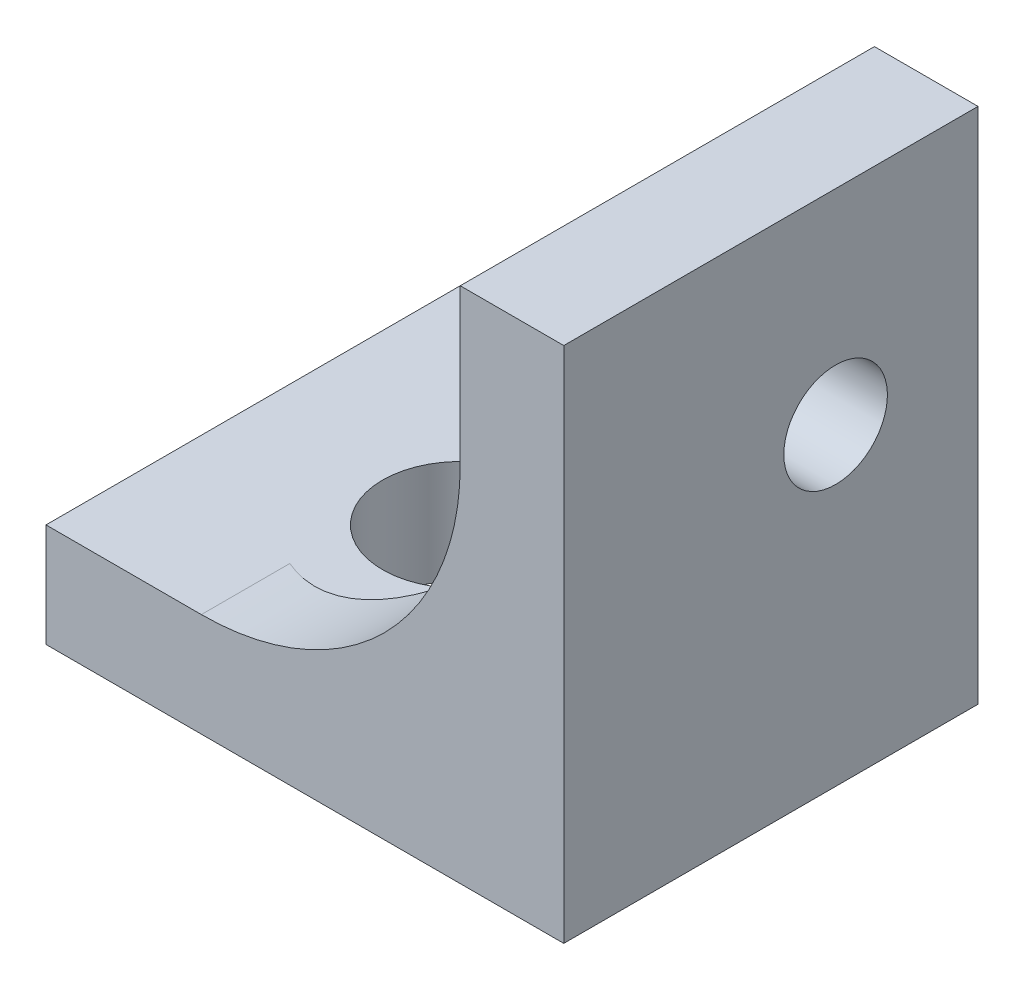
ISO-10303-21;
HEADER;
FILE_DESCRIPTION(('STEP AP214'),'2;1');
FILE_NAME('part.step','',(''),(''),'','','');
FILE_SCHEMA(('AUTOMOTIVE_DESIGN { 1 0 10303 214 1 1 1 1 }'));
ENDSEC;
DATA;
#1=APPLICATION_CONTEXT('core data for automotive mechanical design processes');
#2=APPLICATION_PROTOCOL_DEFINITION('international standard','automotive_design',2000,#1);
#3=PRODUCT_CONTEXT('',#1,'mechanical');
#4=PRODUCT('Part','Part','',(#3));
#5=PRODUCT_RELATED_PRODUCT_CATEGORY('part','',(#4));
#6=PRODUCT_DEFINITION_FORMATION('','',#4);
#7=PRODUCT_DEFINITION_CONTEXT('part definition',#1,'design');
#8=PRODUCT_DEFINITION('design','',#6,#7);
#9=PRODUCT_DEFINITION_SHAPE('','',#8);
#10=(LENGTH_UNIT() NAMED_UNIT(*) SI_UNIT(.MILLI.,.METRE.));
#11=(NAMED_UNIT(*) PLANE_ANGLE_UNIT() SI_UNIT($,.RADIAN.));
#12=(NAMED_UNIT(*) SI_UNIT($,.STERADIAN.) SOLID_ANGLE_UNIT());
#13=UNCERTAINTY_MEASURE_WITH_UNIT(LENGTH_MEASURE(1.E-05),#10,'distance_accuracy_value','');
#14=(GEOMETRIC_REPRESENTATION_CONTEXT(3) GLOBAL_UNCERTAINTY_ASSIGNED_CONTEXT((#13)) GLOBAL_UNIT_ASSIGNED_CONTEXT((#10,
#11,#12)) REPRESENTATION_CONTEXT('',''));
#15=CARTESIAN_POINT('',(0.,0.,0.));
#16=DIRECTION('',(0.,0.,1.));
#17=DIRECTION('',(1.,0.,0.));
#18=AXIS2_PLACEMENT_3D('',#15,#16,#17);
#19=CARTESIAN_POINT('',(-7.,7.,4.));
#20=DIRECTION('',(0.,0.,1.));
#21=DIRECTION('',(1.,0.,0.));
#22=AXIS2_PLACEMENT_3D('',#19,#20,#21);
#23=CYLINDRICAL_SURFACE('',#22,5.);
#24=CARTESIAN_POINT('',(-2.,7.,-2.71969384566991));
#25=CARTESIAN_POINT('',(-1.99999867804241,6.96038055154379,-2.74530406939443));
#26=CARTESIAN_POINT('',(-2.00047164656441,6.91974123514812,-2.76929938437319));
#27=CARTESIAN_POINT('',(-2.00249534014122,6.83667934654765,-2.81392471658101));
#28=CARTESIAN_POINT('',(-2.00404610643408,6.79425670616876,-2.83455460500687));
#29=CARTESIAN_POINT('',(-2.01049830280839,6.66491432502792,-2.89109784935793));
#30=CARTESIAN_POINT('',(-2.0171983755155,6.57572390611684,-2.92179126999705));
#31=CARTESIAN_POINT('',(-2.03600912614743,6.39407270780982,-2.96840841168465));
#32=CARTESIAN_POINT('',(-2.04812482898309,6.30160896478487,-2.98431837354393));
#33=CARTESIAN_POINT('',(-2.07783095478387,6.11622453922833,-3.0012205909028));
#34=CARTESIAN_POINT('',(-2.09542029643804,6.02330395051123,-3.00221579088895));
#35=CARTESIAN_POINT('',(-2.13570181172784,5.83916828172634,-2.98971501753192));
#36=CARTESIAN_POINT('',(-2.15841610957023,5.74796251109971,-2.97615522778554));
#37=CARTESIAN_POINT('',(-2.20800481489154,5.5698454363075,-2.93532181309561));
#38=CARTESIAN_POINT('',(-2.23488127053931,5.48293627440118,-2.90804142140318));
#39=CARTESIAN_POINT('',(-2.29344109394283,5.30967279042823,-2.83861293114494));
#40=CARTESIAN_POINT('',(-2.32532442055952,5.22373154021282,-2.79560439035784));
#41=CARTESIAN_POINT('',(-2.39068723878888,5.06041586547692,-2.69649844284674));
#42=CARTESIAN_POINT('',(-2.42416745957263,4.98304540916136,-2.64039501033892));
#43=CARTESIAN_POINT('',(-2.49334219048328,4.83264972669039,-2.51139812253799));
#44=CARTESIAN_POINT('',(-2.52900498162388,4.76043818085067,-2.43753441079985));
#45=CARTESIAN_POINT('',(-2.59703732742944,4.62947777373248,-2.27728938929331));
#46=CARTESIAN_POINT('',(-2.62940583636023,4.57073318002588,-2.19090412565943));
#47=CARTESIAN_POINT('',(-2.68713893649717,4.46966947272381,-2.00876264992836));
#48=CARTESIAN_POINT('',(-2.71260771209724,4.42710159546281,-1.91317931805099));
#49=CARTESIAN_POINT('',(-2.75395330028,4.35941406929208,-1.71412797213516));
#50=CARTESIAN_POINT('',(-2.76984773589638,4.33426235044072,-1.61067484159505));
#51=CARTESIAN_POINT('',(-2.78819399357045,4.30538792059023,-1.41487942753203));
#52=CARTESIAN_POINT('',(-2.7922409330295,4.29911863076448,-1.32305934670922));
#53=CARTESIAN_POINT('',(-2.79098143941577,4.3010800427812,-1.13964879767555));
#54=CARTESIAN_POINT('',(-2.78567802810436,4.3093060601616,-1.0480582648603));
#55=CARTESIAN_POINT('',(-2.76730450895817,4.3383204198497,-0.876456657996809));
#56=CARTESIAN_POINT('',(-2.75498734256853,4.35789384091786,-0.796151634503493));
#57=CARTESIAN_POINT('',(-2.72441071161088,4.40766803456794,-0.64011795055982));
#58=CARTESIAN_POINT('',(-2.70614968056924,4.43787160884045,-0.564390502749947));
#59=CARTESIAN_POINT('',(-2.66353215930569,4.51063182584533,-0.41307519215602));
#60=CARTESIAN_POINT('',(-2.63880770078916,4.55397679137175,-0.337972459829501));
#61=CARTESIAN_POINT('',(-2.58602526341888,4.65056249100747,-0.195734774209249));
#62=CARTESIAN_POINT('',(-2.55796558268198,4.70380828515845,-0.12860392400199));
#63=CARTESIAN_POINT('',(-2.49602740313364,4.82751806618557,0.00601206104081807));
#64=CARTESIAN_POINT('',(-2.46189736645987,4.89936084390679,0.0721188568921348));
#65=CARTESIAN_POINT('',(-2.39384354783236,5.05310586009823,0.191592551975834));
#66=CARTESIAN_POINT('',(-2.35991991834914,5.13501476496842,0.244950938833224));
#67=CARTESIAN_POINT('',(-2.2921284062949,5.31310745537378,0.340716237850486));
#68=CARTESIAN_POINT('',(-2.25841713255764,5.40988039054042,0.382147553342853));
#69=CARTESIAN_POINT('',(-2.19575791710927,5.61065219764031,0.447229285581904));
#70=CARTESIAN_POINT('',(-2.16680622358936,5.71464528530952,0.470893760300303));
#71=CARTESIAN_POINT('',(-2.11673890430772,5.92092254542664,0.498160391485404));
#72=CARTESIAN_POINT('',(-2.09528003841527,6.02298647350299,0.50279377222896));
#73=CARTESIAN_POINT('',(-2.05893090202978,6.22760282597387,0.493965136591627));
#74=CARTESIAN_POINT('',(-2.04404023107244,6.33015522020103,0.48050422362642));
#75=CARTESIAN_POINT('',(-2.02673648507832,6.48112402780369,0.446847346293491));
#76=CARTESIAN_POINT('',(-2.02181266094272,6.53086331494279,0.433428634479487));
#77=CARTESIAN_POINT('',(-2.01353272925488,6.62910186045213,0.402208310142303));
#78=CARTESIAN_POINT('',(-2.01017671748865,6.67760104288669,0.384406429929458));
#79=CARTESIAN_POINT('',(-2.00492538150202,6.77302301944444,0.344496582096798));
#80=CARTESIAN_POINT('',(-2.00303398677853,6.81994125199201,0.322377228364049));
#81=CARTESIAN_POINT('',(-2.00056856073206,6.91165983724819,0.274052632839682));
#82=CARTESIAN_POINT('',(-1.99999450738326,6.95646022535466,0.247847459370385));
#83=CARTESIAN_POINT('',(-2.,7.,0.219693845669907));
#84=B_SPLINE_CURVE_WITH_KNOTS('',3,(#24,#25,#26,#27,#28,#29,#30,#31,#32,#33,#34,#35,#36,#37,#38,
#39,#40,#41,#42,#43,#44,#45,#46,#47,#48,#49,#50,#51,#52,#53,#54,#55,#56,#57,#58,#59,#60,#61,#62,
#63,#64,#65,#66,#67,#68,#69,#70,#71,#72,#73,#74,#75,#76,#77,#78,#79,#80,#81,#82,#83),
.UNSPECIFIED.,.F.,.F.,(4,2,2,2,2,2,2,2,2,2,2,2,2,2,2,2,2,2,2,2,2,2,2,2,2,2,2,2,2,4),(0.,
0.141445774767373,0.282896961744636,0.565107887498639,0.847581208920995,1.12999876345519,
1.41365965589029,1.69746058204911,1.99994218724748,2.30256325864533,2.62886299270558,
2.95526598610493,3.2764242067249,3.59698946578993,3.87179136397493,4.14650447045827,
4.39614776660585,4.64585690824766,4.91532374998678,5.18492868924562,5.49388338806945,
5.80304380934016,6.13295762301685,6.46261011723661,6.77414339594943,7.08565767778311,
7.24072945131146,7.39581069776172,7.55130659182139,7.70679988598637),.UNSPECIFIED.);
#85=CARTESIAN_POINT('',(-2.,7.,-2.7196938456699));
#86=VERTEX_POINT('',#85);
#87=CARTESIAN_POINT('',(-2.,7.,0.219693845669906));
#88=VERTEX_POINT('',#87);
#89=EDGE_CURVE('E113',#86,#88,#84,.T.);
#90=ORIENTED_EDGE('',*,*,#89,.F.);
#91=DIRECTION('',(0.,0.,-1.));
#92=VECTOR('',#91,1.);
#93=CARTESIAN_POINT('',(-2.,7.,4.));
#94=LINE('',#93,#92);
#95=CARTESIAN_POINT('',(-2.,7.,-4.));
#96=VERTEX_POINT('',#95);
#97=EDGE_CURVE('E123',#96,#86,#94,.F.);
#98=ORIENTED_EDGE('',*,*,#97,.F.);
#99=CARTESIAN_POINT('',(-7.,7.,-4.));
#100=DIRECTION('',(0.,0.,1.));
#101=DIRECTION('',(1.,0.,0.));
#102=AXIS2_PLACEMENT_3D('',#99,#100,#101);
#103=CIRCLE('',#102,5.);
#104=CARTESIAN_POINT('',(-7.,2.,-4.));
#105=VERTEX_POINT('',#104);
#106=EDGE_CURVE('E129',#105,#96,#103,.T.);
#107=ORIENTED_EDGE('',*,*,#106,.F.);
#108=DIRECTION('',(0.,0.,-1.));
#109=VECTOR('',#108,1.);
#110=CARTESIAN_POINT('',(-7.,2.,-4.));
#111=LINE('',#110,#109);
#112=CARTESIAN_POINT('',(-7.,2.,-2.29128784747792));
#113=VERTEX_POINT('',#112);
#114=EDGE_CURVE('E131',#113,#105,#111,.T.);
#115=ORIENTED_EDGE('',*,*,#114,.F.);
#116=CARTESIAN_POINT('',(-7.,2.,2.29128784747792));
#117=CARTESIAN_POINT('',(-6.94096198477514,1.99999114721002,2.31706454380835));
#118=CARTESIAN_POINT('',(-6.88091838617668,2.00104545803731,2.3405427218191));
#119=CARTESIAN_POINT('',(-6.75927544306799,2.00542966220429,2.38277858873866));
#120=CARTESIAN_POINT('',(-6.69767611366641,2.00875953345281,2.40153632347119));
#121=CARTESIAN_POINT('',(-6.57356747684374,2.01783011104039,2.43415801837006));
#122=CARTESIAN_POINT('',(-6.51106155835243,2.0235633569466,2.4480368802426));
#123=CARTESIAN_POINT('',(-6.38545900662037,2.03750646241955,2.47093159657459));
#124=CARTESIAN_POINT('',(-6.32236240453439,2.04571619207281,2.47994770605927));
#125=CARTESIAN_POINT('',(-6.13281515424676,2.07412554880528,2.49969114729352));
#126=CARTESIAN_POINT('',(-6.0060769240425,2.0981074672309,2.50312142115184));
#127=CARTESIAN_POINT('',(-5.75577042764084,2.15557667739918,2.491203692425));
#128=CARTESIAN_POINT('',(-5.6322030589092,2.18906662858915,2.47585043200378));
#129=CARTESIAN_POINT('',(-5.38833747956002,2.2651055098891,2.427277861546));
#130=CARTESIAN_POINT('',(-5.26818012943385,2.30784533437773,2.39365517434472));
#131=CARTESIAN_POINT('',(-5.03642846732498,2.40000300927694,2.31013563825121));
#132=CARTESIAN_POINT('',(-4.92483766014765,2.4494235703686,2.26023217182328));
#133=CARTESIAN_POINT('',(-4.69802745958016,2.55941872378511,2.13857116038279));
#134=CARTESIAN_POINT('',(-4.58417149296455,2.6206113507234,2.06483406389245));
#135=CARTESIAN_POINT('',(-4.37046150514378,2.74548617539239,1.90073524019834));
#136=CARTESIAN_POINT('',(-4.27062935087434,2.80917206737534,1.81034804718773));
#137=CARTESIAN_POINT('',(-4.07378345831024,2.94373433611529,1.60095996517152));
#138=CARTESIAN_POINT('',(-3.97897933699119,3.01441749366705,1.47974217495322));
#139=CARTESIAN_POINT('',(-3.81161737336704,3.14700413471519,1.21857661319708));
#140=CARTESIAN_POINT('',(-3.73901440084266,3.20892528988467,1.07866768047825));
#141=CARTESIAN_POINT('',(-3.64015967736329,3.2967201200565,0.832066492851735));
#142=CARTESIAN_POINT('',(-3.60653671067226,3.32770151434879,0.730154003864886));
#143=CARTESIAN_POINT('',(-3.55235061862624,3.37852186457462,0.520297210142897));
#144=CARTESIAN_POINT('',(-3.53176510746992,3.39837991289705,0.412363592646484));
#145=CARTESIAN_POINT('',(-3.50492247996616,3.42441445787553,0.192227375625661));
#146=CARTESIAN_POINT('',(-3.49876925975788,3.43049173829739,0.079999697037371));
#147=CARTESIAN_POINT('',(-3.50164141651307,3.42767731307922,-0.144082408565495));
#148=CARTESIAN_POINT('',(-3.51066849878968,3.41878392567573,-0.255936792230759));
#149=CARTESIAN_POINT('',(-3.54157984844148,3.38894535960462,-0.465074324780901));
#150=CARTESIAN_POINT('',(-3.56216917304701,3.36921785858062,-0.562735872137342));
#151=CARTESIAN_POINT('',(-3.61401461105216,3.32082097472011,-0.752861763580056));
#152=CARTESIAN_POINT('',(-3.64527963207713,3.29214412642051,-0.845321692240169));
#153=CARTESIAN_POINT('',(-3.734330717145,3.21312876224577,-1.06624187044088));
#154=CARTESIAN_POINT('',(-3.79766914346787,3.15895508615215,-1.19109185052261));
#155=CARTESIAN_POINT('',(-3.94206443766487,3.04302821598333,-1.42618349262765));
#156=CARTESIAN_POINT('',(-4.02315211617814,2.98126192478186,-1.53639921002829));
#157=CARTESIAN_POINT('',(-4.20300415244097,2.85401309557393,-1.74355668045803));
#158=CARTESIAN_POINT('',(-4.30209186314221,2.78848074592646,-1.84018610079824));
#159=CARTESIAN_POINT('',(-4.51557381038937,2.65912713692152,-2.01633412232465));
#160=CARTESIAN_POINT('',(-4.62996896632202,2.59530598061733,-2.09585169500038));
#161=CARTESIAN_POINT('',(-4.81881139310086,2.50020292661337,-2.20474194179813));
#162=CARTESIAN_POINT('',(-4.88855481799534,2.46701176280033,-2.24073979802579));
#163=CARTESIAN_POINT('',(-5.03198326195212,2.40292851918174,-2.30632938204848));
#164=CARTESIAN_POINT('',(-5.10566635183662,2.37203533150633,-2.33592421009499));
#165=CARTESIAN_POINT('',(-5.25650339281285,2.31312752374316,-2.38821720007174));
#166=CARTESIAN_POINT('',(-5.33365544123344,2.28511135269217,-2.41091909095104));
#167=CARTESIAN_POINT('',(-5.4908766243784,2.23246261804924,-2.44894460438466));
#168=CARTESIAN_POINT('',(-5.5709450856177,2.20782927945193,-2.46426991893144));
#169=CARTESIAN_POINT('',(-5.72337486721809,2.16515665881619,-2.48569116847772));
#170=CARTESIAN_POINT('',(-5.79548843700092,2.14667973068413,-2.49268325546851));
#171=CARTESIAN_POINT('',(-5.9407849419537,2.11291258862531,-2.50035672736334));
#172=CARTESIAN_POINT('',(-6.01396768054886,2.09762179660108,-2.50103925805934));
#173=CARTESIAN_POINT('',(-6.16065954978825,2.07038886961839,-2.49591034519498));
#174=CARTESIAN_POINT('',(-6.23416830416922,2.05844356621296,-2.49010507229441));
#175=CARTESIAN_POINT('',(-6.38081478754785,2.03793446198803,-2.47193037653216));
#176=CARTESIAN_POINT('',(-6.45395265360361,2.02936930605651,-2.4595635888742));
#177=CARTESIAN_POINT('',(-6.60753526937869,2.01476500371238,-2.4264690019102));
#178=CARTESIAN_POINT('',(-6.6878471131274,2.00913242371626,-2.40493980885806));
#179=CARTESIAN_POINT('',(-6.84600202563025,2.00173832478192,-2.35397884251859));
#180=CARTESIAN_POINT('',(-6.92384791645423,1.99997221071715,-2.32455649665569));
#181=CARTESIAN_POINT('',(-7.,2.,-2.29128784747792));
#182=B_SPLINE_CURVE_WITH_KNOTS('',3,(#116,#117,#118,#119,#120,#121,#122,#123,#124,#125,#126,
#127,#128,#129,#130,#131,#132,#133,#134,#135,#136,#137,#138,#139,#140,#141,#142,#143,#144,#145,
#146,#147,#148,#149,#150,#151,#152,#153,#154,#155,#156,#157,#158,#159,#160,#161,#162,#163,#164,
#165,#166,#167,#168,#169,#170,#171,#172,#173,#174,#175,#176,#177,#178,#179,#180,#181),
.UNSPECIFIED.,.F.,.F.,(4,2,2,2,2,2,2,2,2,2,2,2,2,2,2,2,2,2,2,2,2,2,2,2,2,2,2,2,2,2,2,2,4),(0.,
0.193204696427855,0.386407517248053,0.579014997460452,0.771612375462984,1.15671471628132,
1.54192487857225,1.93600789278291,2.33025128717257,2.77495122798063,3.22033705761871,
3.72599476952157,4.2306176468024,4.56448697997014,4.89778148155224,5.23346805836993,
5.56919234780726,5.87320626041174,6.17747445959617,6.62537995922767,7.07406922539843,
7.53180242304767,7.98956312514787,8.24490297301262,8.5001189110445,8.75519653505328,
9.0102156230542,9.23420268830272,9.45814907753344,9.68188264870141,9.90552643301723,
10.1550284240598,10.4042337315042),.UNSPECIFIED.);
#183=CARTESIAN_POINT('',(-7.,2.,2.29128784747792));
#184=VERTEX_POINT('',#183);
#185=EDGE_CURVE('E11',#184,#113,#182,.T.);
#186=ORIENTED_EDGE('',*,*,#185,.F.);
#187=DIRECTION('',(0.,0.,-1.));
#188=VECTOR('',#187,1.);
#189=CARTESIAN_POINT('',(-7.,2.,-4.));
#190=LINE('',#189,#188);
#191=CARTESIAN_POINT('',(-7.,2.,4.));
#192=VERTEX_POINT('',#191);
#193=EDGE_CURVE('E127',#192,#184,#190,.T.);
#194=ORIENTED_EDGE('',*,*,#193,.F.);
#195=CARTESIAN_POINT('',(-7.,7.,4.));
#196=DIRECTION('',(0.,0.,1.));
#197=DIRECTION('',(1.,0.,0.));
#198=AXIS2_PLACEMENT_3D('',#195,#196,#197);
#199=CIRCLE('',#198,5.);
#200=CARTESIAN_POINT('',(-2.,7.,4.));
#201=VERTEX_POINT('',#200);
#202=EDGE_CURVE('E50',#201,#192,#199,.F.);
#203=ORIENTED_EDGE('',*,*,#202,.F.);
#204=DIRECTION('',(0.,0.,-1.));
#205=VECTOR('',#204,1.);
#206=CARTESIAN_POINT('',(-2.,7.,4.));
#207=LINE('',#206,#205);
#208=EDGE_CURVE('E64',#88,#201,#207,.F.);
#209=ORIENTED_EDGE('',*,*,#208,.F.);
#210=EDGE_LOOP('',(#90,#98,#107,#115,#186,#194,#203,#209));
#211=FACE_BOUND('',#210,.T.);
#212=ADVANCED_FACE('F37',(#211),#23,.F.);
#213=CARTESIAN_POINT('',(6.,6.05,-1.25));
#214=DIRECTION('',(-1.,0.,0.));
#215=DIRECTION('',(0.,-1.,0.));
#216=AXIS2_PLACEMENT_3D('',#213,#214,#215);
#217=CYLINDRICAL_SURFACE('',#216,1.);
#218=CARTESIAN_POINT('',(0.,6.05,-1.25));
#219=DIRECTION('',(-1.,0.,0.));
#220=DIRECTION('',(0.,0.,1.));
#221=AXIS2_PLACEMENT_3D('',#218,#219,#220);
#222=CIRCLE('',#221,1.);
#223=CARTESIAN_POINT('',(0.,6.05,-0.249999999999999));
#224=VERTEX_POINT('',#223);
#225=EDGE_CURVE('E156',#224,#224,#222,.T.);
#226=ORIENTED_EDGE('',*,*,#225,.F.);
#227=EDGE_LOOP('',(#226));
#228=FACE_BOUND('',#227,.T.);
#229=CARTESIAN_POINT('',(-2.,6.05,-1.25));
#230=DIRECTION('',(-1.,0.,0.));
#231=DIRECTION('',(0.,-1.,0.));
#232=AXIS2_PLACEMENT_3D('',#229,#230,#231);
#233=CIRCLE('',#232,1.);
#234=CARTESIAN_POINT('',(-2.,5.05,-1.25));
#235=VERTEX_POINT('',#234);
#236=EDGE_CURVE('E153',#235,#235,#233,.T.);
#237=ORIENTED_EDGE('',*,*,#236,.T.);
#238=EDGE_LOOP('',(#237));
#239=FACE_BOUND('',#238,.T.);
#240=ADVANCED_FACE('F237',(#228,#239),#217,.F.);
#241=CARTESIAN_POINT('',(-6.,-6.,0.));
#242=DIRECTION('',(0.,1.,0.));
#243=DIRECTION('',(-1.,0.,0.));
#244=AXIS2_PLACEMENT_3D('',#241,#242,#243);
#245=CYLINDRICAL_SURFACE('',#244,1.5);
#246=CARTESIAN_POINT('',(-6.,0.,0.));
#247=DIRECTION('',(0.,1.,0.));
#248=DIRECTION('',(0.,0.,1.));
#249=AXIS2_PLACEMENT_3D('',#246,#247,#248);
#250=CIRCLE('',#249,1.5);
#251=CARTESIAN_POINT('',(-6.,0.,1.5));
#252=VERTEX_POINT('',#251);
#253=EDGE_CURVE('E169',#252,#252,#250,.T.);
#254=ORIENTED_EDGE('',*,*,#253,.F.);
#255=EDGE_LOOP('',(#254));
#256=FACE_BOUND('',#255,.T.);
#257=CARTESIAN_POINT('',(-6.,2.,0.));
#258=DIRECTION('',(0.,1.,0.));
#259=DIRECTION('',(-1.,0.,0.));
#260=AXIS2_PLACEMENT_3D('',#257,#258,#259);
#261=CIRCLE('',#260,1.5);
#262=CARTESIAN_POINT('',(-7.5,2.,0.));
#263=VERTEX_POINT('',#262);
#264=EDGE_CURVE('E166',#263,#263,#261,.T.);
#265=ORIENTED_EDGE('',*,*,#264,.T.);
#266=EDGE_LOOP('',(#265));
#267=FACE_BOUND('',#266,.T.);
#268=ADVANCED_FACE('F241',(#256,#267),#245,.F.);
#269=CARTESIAN_POINT('',(-10.,2.,4.));
#270=DIRECTION('',(1.,0.,0.));
#271=DIRECTION('',(0.,0.,-1.));
#272=AXIS2_PLACEMENT_3D('',#269,#270,#271);
#273=PLANE('',#272);
#274=DIRECTION('',(0.,-1.,0.));
#275=VECTOR('',#274,1.);
#276=CARTESIAN_POINT('',(-10.,2.,-4.));
#277=LINE('',#276,#275);
#278=CARTESIAN_POINT('',(-10.,2.,-4.));
#279=VERTEX_POINT('',#278);
#280=CARTESIAN_POINT('',(-10.,0.,-4.));
#281=VERTEX_POINT('',#280);
#282=EDGE_CURVE('E172',#279,#281,#277,.T.);
#283=ORIENTED_EDGE('',*,*,#282,.T.);
#284=DIRECTION('',(0.,0.,-1.));
#285=VECTOR('',#284,1.);
#286=CARTESIAN_POINT('',(-10.,0.,4.));
#287=LINE('',#286,#285);
#288=CARTESIAN_POINT('',(-10.,0.,4.));
#289=VERTEX_POINT('',#288);
#290=EDGE_CURVE('E204',#289,#281,#287,.T.);
#291=ORIENTED_EDGE('',*,*,#290,.F.);
#292=DIRECTION('',(0.,-1.,0.));
#293=VECTOR('',#292,1.);
#294=CARTESIAN_POINT('',(-10.,2.,4.));
#295=LINE('',#294,#293);
#296=CARTESIAN_POINT('',(-10.,2.,4.));
#297=VERTEX_POINT('',#296);
#298=EDGE_CURVE('E173',#297,#289,#295,.T.);
#299=ORIENTED_EDGE('',*,*,#298,.F.);
#300=DIRECTION('',(0.,0.,-1.));
#301=VECTOR('',#300,1.);
#302=CARTESIAN_POINT('',(-10.,2.,4.));
#303=LINE('',#302,#301);
#304=EDGE_CURVE('E145',#297,#279,#303,.T.);
#305=ORIENTED_EDGE('',*,*,#304,.T.);
#306=EDGE_LOOP('',(#283,#291,#299,#305));
#307=FACE_BOUND('',#306,.T.);
#308=ADVANCED_FACE('F214',(#307),#273,.F.);
#309=CARTESIAN_POINT('',(-10.,0.,4.));
#310=DIRECTION('',(0.,1.,0.));
#311=DIRECTION('',(0.,0.,1.));
#312=AXIS2_PLACEMENT_3D('',#309,#310,#311);
#313=PLANE('',#312);
#314=ORIENTED_EDGE('',*,*,#253,.T.);
#315=EDGE_LOOP('',(#314));
#316=FACE_BOUND('',#315,.T.);
#317=DIRECTION('',(1.,0.,0.));
#318=VECTOR('',#317,1.);
#319=CARTESIAN_POINT('',(-10.,0.,-4.));
#320=LINE('',#319,#318);
#321=CARTESIAN_POINT('',(0.,0.,-4.));
#322=VERTEX_POINT('',#321);
#323=EDGE_CURVE('E185',#281,#322,#320,.T.);
#324=ORIENTED_EDGE('',*,*,#323,.T.);
#325=DIRECTION('',(0.,0.,-1.));
#326=VECTOR('',#325,1.);
#327=CARTESIAN_POINT('',(0.,0.,4.));
#328=LINE('',#327,#326);
#329=CARTESIAN_POINT('',(0.,0.,4.));
#330=VERTEX_POINT('',#329);
#331=EDGE_CURVE('E201',#330,#322,#328,.T.);
#332=ORIENTED_EDGE('',*,*,#331,.F.);
#333=DIRECTION('',(1.,0.,0.));
#334=VECTOR('',#333,1.);
#335=CARTESIAN_POINT('',(-10.,0.,4.));
#336=LINE('',#335,#334);
#337=EDGE_CURVE('E175',#289,#330,#336,.T.);
#338=ORIENTED_EDGE('',*,*,#337,.F.);
#339=ORIENTED_EDGE('',*,*,#290,.T.);
#340=EDGE_LOOP('',(#324,#332,#338,#339));
#341=FACE_BOUND('',#340,.T.);
#342=ADVANCED_FACE('F219',(#316,#341),#313,.F.);
#343=CARTESIAN_POINT('',(0.,0.,4.));
#344=DIRECTION('',(-1.,0.,0.));
#345=DIRECTION('',(0.,0.,1.));
#346=AXIS2_PLACEMENT_3D('',#343,#344,#345);
#347=PLANE('',#346);
#348=ORIENTED_EDGE('',*,*,#225,.T.);
#349=EDGE_LOOP('',(#348));
#350=FACE_BOUND('',#349,.T.);
#351=DIRECTION('',(0.,1.,0.));
#352=VECTOR('',#351,1.);
#353=CARTESIAN_POINT('',(0.,0.,-4.));
#354=LINE('',#353,#352);
#355=CARTESIAN_POINT('',(0.,10.,-4.));
#356=VERTEX_POINT('',#355);
#357=EDGE_CURVE('E187',#322,#356,#354,.T.);
#358=ORIENTED_EDGE('',*,*,#357,.T.);
#359=DIRECTION('',(0.,0.,-1.));
#360=VECTOR('',#359,1.);
#361=CARTESIAN_POINT('',(0.,10.,4.));
#362=LINE('',#361,#360);
#363=CARTESIAN_POINT('',(0.,10.,4.));
#364=VERTEX_POINT('',#363);
#365=EDGE_CURVE('E198',#364,#356,#362,.T.);
#366=ORIENTED_EDGE('',*,*,#365,.F.);
#367=DIRECTION('',(0.,1.,0.));
#368=VECTOR('',#367,1.);
#369=CARTESIAN_POINT('',(0.,0.,4.));
#370=LINE('',#369,#368);
#371=EDGE_CURVE('E178',#330,#364,#370,.T.);
#372=ORIENTED_EDGE('',*,*,#371,.F.);
#373=ORIENTED_EDGE('',*,*,#331,.T.);
#374=EDGE_LOOP('',(#358,#366,#372,#373));
#375=FACE_BOUND('',#374,.T.);
#376=ADVANCED_FACE('F221',(#350,#375),#347,.F.);
#377=CARTESIAN_POINT('',(0.,10.,4.));
#378=DIRECTION('',(0.,-1.,0.));
#379=DIRECTION('',(0.,0.,-1.));
#380=AXIS2_PLACEMENT_3D('',#377,#378,#379);
#381=PLANE('',#380);
#382=DIRECTION('',(-1.,0.,0.));
#383=VECTOR('',#382,1.);
#384=CARTESIAN_POINT('',(0.,10.,-4.));
#385=LINE('',#384,#383);
#386=CARTESIAN_POINT('',(-2.,10.,-4.));
#387=VERTEX_POINT('',#386);
#388=EDGE_CURVE('E189',#356,#387,#385,.T.);
#389=ORIENTED_EDGE('',*,*,#388,.T.);
#390=DIRECTION('',(0.,0.,-1.));
#391=VECTOR('',#390,1.);
#392=CARTESIAN_POINT('',(-2.,10.,4.));
#393=LINE('',#392,#391);
#394=CARTESIAN_POINT('',(-2.,10.,4.));
#395=VERTEX_POINT('',#394);
#396=EDGE_CURVE('E195',#395,#387,#393,.T.);
#397=ORIENTED_EDGE('',*,*,#396,.F.);
#398=DIRECTION('',(-1.,0.,0.));
#399=VECTOR('',#398,1.);
#400=CARTESIAN_POINT('',(0.,10.,4.));
#401=LINE('',#400,#399);
#402=EDGE_CURVE('E180',#364,#395,#401,.T.);
#403=ORIENTED_EDGE('',*,*,#402,.F.);
#404=ORIENTED_EDGE('',*,*,#365,.T.);
#405=EDGE_LOOP('',(#389,#397,#403,#404));
#406=FACE_BOUND('',#405,.T.);
#407=ADVANCED_FACE('F226',(#406),#381,.F.);
#408=CARTESIAN_POINT('',(-2.,10.,4.));
#409=DIRECTION('',(1.,0.,0.));
#410=DIRECTION('',(0.,1.,0.));
#411=AXIS2_PLACEMENT_3D('',#408,#409,#410);
#412=PLANE('',#411);
#413=CARTESIAN_POINT('',(-2.,6.05,-1.25));
#414=DIRECTION('',(-1.,0.,0.));
#415=DIRECTION('',(0.,-1.,0.));
#416=AXIS2_PLACEMENT_3D('',#413,#414,#415);
#417=CIRCLE('',#416,1.75);
#418=EDGE_CURVE('E115',#86,#88,#417,.T.);
#419=ORIENTED_EDGE('',*,*,#418,.T.);
#420=ORIENTED_EDGE('',*,*,#208,.T.);
#421=DIRECTION('',(0.,-1.,0.));
#422=VECTOR('',#421,1.);
#423=CARTESIAN_POINT('',(-2.,10.,4.));
#424=LINE('',#423,#422);
#425=EDGE_CURVE('E141',#395,#201,#424,.T.);
#426=ORIENTED_EDGE('',*,*,#425,.F.);
#427=ORIENTED_EDGE('',*,*,#396,.T.);
#428=DIRECTION('',(0.,-1.,0.));
#429=VECTOR('',#428,1.);
#430=CARTESIAN_POINT('',(-2.,10.,-4.));
#431=LINE('',#430,#429);
#432=EDGE_CURVE('E191',#387,#96,#431,.T.);
#433=ORIENTED_EDGE('',*,*,#432,.T.);
#434=ORIENTED_EDGE('',*,*,#97,.T.);
#435=EDGE_LOOP('',(#419,#420,#426,#427,#433,#434));
#436=FACE_BOUND('',#435,.T.);
#437=ORIENTED_EDGE('',*,*,#236,.F.);
#438=EDGE_LOOP('',(#437));
#439=FACE_BOUND('',#438,.T.);
#440=ADVANCED_FACE('F120',(#436,#439),#412,.F.);
#441=CARTESIAN_POINT('',(-2.,2.,4.));
#442=DIRECTION('',(0.,-1.,0.));
#443=DIRECTION('',(1.,0.,0.));
#444=AXIS2_PLACEMENT_3D('',#441,#442,#443);
#445=PLANE('',#444);
#446=ORIENTED_EDGE('',*,*,#193,.T.);
#447=CARTESIAN_POINT('',(-6.,2.,0.));
#448=DIRECTION('',(0.,1.,0.));
#449=DIRECTION('',(-1.,0.,0.));
#450=AXIS2_PLACEMENT_3D('',#447,#448,#449);
#451=CIRCLE('',#450,2.5);
#452=EDGE_CURVE('E57',#184,#113,#451,.T.);
#453=ORIENTED_EDGE('',*,*,#452,.T.);
#454=ORIENTED_EDGE('',*,*,#114,.T.);
#455=DIRECTION('',(-1.,0.,0.));
#456=VECTOR('',#455,1.);
#457=CARTESIAN_POINT('',(-2.,2.,-4.));
#458=LINE('',#457,#456);
#459=EDGE_CURVE('E176',#105,#279,#458,.T.);
#460=ORIENTED_EDGE('',*,*,#459,.T.);
#461=ORIENTED_EDGE('',*,*,#304,.F.);
#462=DIRECTION('',(-1.,0.,0.));
#463=VECTOR('',#462,1.);
#464=CARTESIAN_POINT('',(-2.,2.,4.));
#465=LINE('',#464,#463);
#466=EDGE_CURVE('E139',#192,#297,#465,.T.);
#467=ORIENTED_EDGE('',*,*,#466,.F.);
#468=EDGE_LOOP('',(#446,#453,#454,#460,#461,#467));
#469=FACE_BOUND('',#468,.T.);
#470=ORIENTED_EDGE('',*,*,#264,.F.);
#471=EDGE_LOOP('',(#470));
#472=FACE_BOUND('',#471,.T.);
#473=ADVANCED_FACE('F142',(#469,#472),#445,.F.);
#474=CARTESIAN_POINT('',(0.,0.,4.));
#475=DIRECTION('',(0.,0.,1.));
#476=DIRECTION('',(1.,0.,0.));
#477=AXIS2_PLACEMENT_3D('',#474,#475,#476);
#478=PLANE('',#477);
#479=ORIENTED_EDGE('',*,*,#298,.T.);
#480=ORIENTED_EDGE('',*,*,#337,.T.);
#481=ORIENTED_EDGE('',*,*,#371,.T.);
#482=ORIENTED_EDGE('',*,*,#402,.T.);
#483=ORIENTED_EDGE('',*,*,#425,.T.);
#484=ORIENTED_EDGE('',*,*,#202,.T.);
#485=ORIENTED_EDGE('',*,*,#466,.T.);
#486=EDGE_LOOP('',(#479,#480,#481,#482,#483,#484,#485));
#487=FACE_BOUND('',#486,.T.);
#488=ADVANCED_FACE('F138',(#487),#478,.T.);
#489=CARTESIAN_POINT('',(0.,0.,-4.));
#490=DIRECTION('',(0.,0.,1.));
#491=DIRECTION('',(1.,0.,0.));
#492=AXIS2_PLACEMENT_3D('',#489,#490,#491);
#493=PLANE('',#492);
#494=ORIENTED_EDGE('',*,*,#282,.F.);
#495=ORIENTED_EDGE('',*,*,#459,.F.);
#496=ORIENTED_EDGE('',*,*,#106,.T.);
#497=ORIENTED_EDGE('',*,*,#432,.F.);
#498=ORIENTED_EDGE('',*,*,#388,.F.);
#499=ORIENTED_EDGE('',*,*,#357,.F.);
#500=ORIENTED_EDGE('',*,*,#323,.F.);
#501=EDGE_LOOP('',(#494,#495,#496,#497,#498,#499,#500));
#502=FACE_BOUND('',#501,.T.);
#503=ADVANCED_FACE('F209',(#502),#493,.F.);
#504=CARTESIAN_POINT('',(-6.,10.,0.));
#505=DIRECTION('',(0.,-1.,0.));
#506=DIRECTION('',(1.,0.,0.));
#507=AXIS2_PLACEMENT_3D('',#504,#505,#506);
#508=CYLINDRICAL_SURFACE('',#507,2.5);
#509=ORIENTED_EDGE('',*,*,#185,.T.);
#510=ORIENTED_EDGE('',*,*,#452,.F.);
#511=EDGE_LOOP('',(#509,#510));
#512=FACE_BOUND('',#511,.T.);
#513=ADVANCED_FACE('F152',(#512),#508,.F.);
#514=CARTESIAN_POINT('',(-10.,6.05,-1.25));
#515=DIRECTION('',(1.,0.,0.));
#516=DIRECTION('',(0.,1.,0.));
#517=AXIS2_PLACEMENT_3D('',#514,#515,#516);
#518=CYLINDRICAL_SURFACE('',#517,1.75);
#519=ORIENTED_EDGE('',*,*,#89,.T.);
#520=ORIENTED_EDGE('',*,*,#418,.F.);
#521=EDGE_LOOP('',(#519,#520));
#522=FACE_BOUND('',#521,.T.);
#523=ADVANCED_FACE('F114',(#522),#518,.F.);
#524=CLOSED_SHELL('',(#212,#240,#268,#308,#342,#376,#407,#440,#473,#488,#503,#513,#523));
#525=MANIFOLD_SOLID_BREP('B2',#524);
#526=ADVANCED_BREP_SHAPE_REPRESENTATION('',(#18,#525),#14);
#527=SHAPE_DEFINITION_REPRESENTATION(#9,#526);
ENDSEC;
END-ISO-10303-21;
